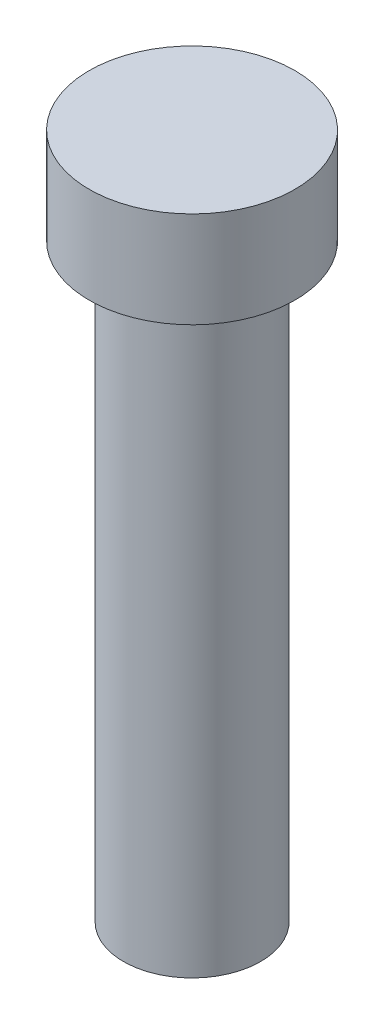
ISO-10303-21;
HEADER;
FILE_DESCRIPTION(('STEP AP214'),'2;1');
FILE_NAME('part.step','',(''),(''),'','','');
FILE_SCHEMA(('AUTOMOTIVE_DESIGN { 1 0 10303 214 1 1 1 1 }'));
ENDSEC;
DATA;
#1=APPLICATION_CONTEXT('core data for automotive mechanical design processes');
#2=APPLICATION_PROTOCOL_DEFINITION('international standard','automotive_design',2000,#1);
#3=PRODUCT_CONTEXT('',#1,'mechanical');
#4=PRODUCT('Part','Part','',(#3));
#5=PRODUCT_RELATED_PRODUCT_CATEGORY('part','',(#4));
#6=PRODUCT_DEFINITION_FORMATION('','',#4);
#7=PRODUCT_DEFINITION_CONTEXT('part definition',#1,'design');
#8=PRODUCT_DEFINITION('design','',#6,#7);
#9=PRODUCT_DEFINITION_SHAPE('','',#8);
#10=(LENGTH_UNIT() NAMED_UNIT(*) SI_UNIT(.MILLI.,.METRE.));
#11=(NAMED_UNIT(*) PLANE_ANGLE_UNIT() SI_UNIT($,.RADIAN.));
#12=(NAMED_UNIT(*) SI_UNIT($,.STERADIAN.) SOLID_ANGLE_UNIT());
#13=UNCERTAINTY_MEASURE_WITH_UNIT(LENGTH_MEASURE(1.E-05),#10,'distance_accuracy_value','');
#14=(GEOMETRIC_REPRESENTATION_CONTEXT(3) GLOBAL_UNCERTAINTY_ASSIGNED_CONTEXT((#13)) GLOBAL_UNIT_ASSIGNED_CONTEXT((#10,
#11,#12)) REPRESENTATION_CONTEXT('',''));
#15=CARTESIAN_POINT('',(0.,0.,0.));
#16=DIRECTION('',(0.,0.,1.));
#17=DIRECTION('',(1.,0.,0.));
#18=AXIS2_PLACEMENT_3D('',#15,#16,#17);
#19=CARTESIAN_POINT('',(0.,50.,0.));
#20=DIRECTION('',(0.,1.,0.));
#21=DIRECTION('',(0.,0.,1.));
#22=AXIS2_PLACEMENT_3D('',#19,#20,#21);
#23=PLANE('',#22);
#24=CARTESIAN_POINT('',(0.,50.,0.));
#25=DIRECTION('',(0.,-1.,0.));
#26=DIRECTION('',(0.,0.,-1.));
#27=AXIS2_PLACEMENT_3D('',#24,#25,#26);
#28=CIRCLE('',#27,7.5);
#29=CARTESIAN_POINT('',(0.,50.,-7.5));
#30=VERTEX_POINT('',#29);
#31=EDGE_CURVE('E10',#30,#30,#28,.T.);
#32=ORIENTED_EDGE('',*,*,#31,.F.);
#33=EDGE_LOOP('',(#32));
#34=FACE_BOUND('',#33,.T.);
#35=ADVANCED_FACE('F31',(#34),#23,.T.);
#36=CARTESIAN_POINT('',(0.,0.,0.));
#37=DIRECTION('',(0.,-1.,0.));
#38=DIRECTION('',(0.,0.,-1.));
#39=AXIS2_PLACEMENT_3D('',#36,#37,#38);
#40=CYLINDRICAL_SURFACE('',#39,7.5);
#41=ORIENTED_EDGE('',*,*,#31,.T.);
#42=EDGE_LOOP('',(#41));
#43=FACE_BOUND('',#42,.T.);
#44=CARTESIAN_POINT('',(0.,43.,0.));
#45=DIRECTION('',(0.,-1.,0.));
#46=DIRECTION('',(0.,0.,-1.));
#47=AXIS2_PLACEMENT_3D('',#44,#45,#46);
#48=CIRCLE('',#47,7.5);
#49=CARTESIAN_POINT('',(0.,43.,-7.5));
#50=VERTEX_POINT('',#49);
#51=EDGE_CURVE('E37',#50,#50,#48,.T.);
#52=ORIENTED_EDGE('',*,*,#51,.F.);
#53=EDGE_LOOP('',(#52));
#54=FACE_BOUND('',#53,.T.);
#55=ADVANCED_FACE('F63',(#43,#54),#40,.T.);
#56=CARTESIAN_POINT('',(7.5,43.,0.));
#57=DIRECTION('',(0.,-1.,0.));
#58=DIRECTION('',(0.,0.,-1.));
#59=AXIS2_PLACEMENT_3D('',#56,#57,#58);
#60=PLANE('',#59);
#61=ORIENTED_EDGE('',*,*,#51,.T.);
#62=EDGE_LOOP('',(#61));
#63=FACE_BOUND('',#62,.T.);
#64=CARTESIAN_POINT('',(0.,43.,0.));
#65=DIRECTION('',(0.,-1.,0.));
#66=DIRECTION('',(0.,0.,-1.));
#67=AXIS2_PLACEMENT_3D('',#64,#65,#66);
#68=CIRCLE('',#67,5.);
#69=CARTESIAN_POINT('',(0.,43.,-5.));
#70=VERTEX_POINT('',#69);
#71=EDGE_CURVE('E41',#70,#70,#68,.T.);
#72=ORIENTED_EDGE('',*,*,#71,.F.);
#73=EDGE_LOOP('',(#72));
#74=FACE_BOUND('',#73,.T.);
#75=ADVANCED_FACE('F55',(#63,#74),#60,.T.);
#76=CARTESIAN_POINT('',(0.,0.,0.));
#77=DIRECTION('',(0.,-1.,0.));
#78=DIRECTION('',(0.,0.,-1.));
#79=AXIS2_PLACEMENT_3D('',#76,#77,#78);
#80=CYLINDRICAL_SURFACE('',#79,5.);
#81=ORIENTED_EDGE('',*,*,#71,.T.);
#82=EDGE_LOOP('',(#81));
#83=FACE_BOUND('',#82,.T.);
#84=CARTESIAN_POINT('',(0.,0.,0.));
#85=DIRECTION('',(0.,-1.,0.));
#86=DIRECTION('',(0.,0.,-1.));
#87=AXIS2_PLACEMENT_3D('',#84,#85,#86);
#88=CIRCLE('',#87,5.);
#89=CARTESIAN_POINT('',(0.,0.,-5.));
#90=VERTEX_POINT('',#89);
#91=EDGE_CURVE('E45',#90,#90,#88,.T.);
#92=ORIENTED_EDGE('',*,*,#91,.F.);
#93=EDGE_LOOP('',(#92));
#94=FACE_BOUND('',#93,.T.);
#95=ADVANCED_FACE('F53',(#83,#94),#80,.T.);
#96=CARTESIAN_POINT('',(0.,0.,0.));
#97=DIRECTION('',(0.,-1.,0.));
#98=DIRECTION('',(0.,0.,-1.));
#99=AXIS2_PLACEMENT_3D('',#96,#97,#98);
#100=PLANE('',#99);
#101=ORIENTED_EDGE('',*,*,#91,.T.);
#102=EDGE_LOOP('',(#101));
#103=FACE_BOUND('',#102,.T.);
#104=ADVANCED_FACE('F51',(#103),#100,.T.);
#105=CLOSED_SHELL('',(#35,#55,#75,#95,#104));
#106=MANIFOLD_SOLID_BREP('B2',#105);
#107=ADVANCED_BREP_SHAPE_REPRESENTATION('',(#18,#106),#14);
#108=SHAPE_DEFINITION_REPRESENTATION(#9,#107);
ENDSEC;
END-ISO-10303-21;
